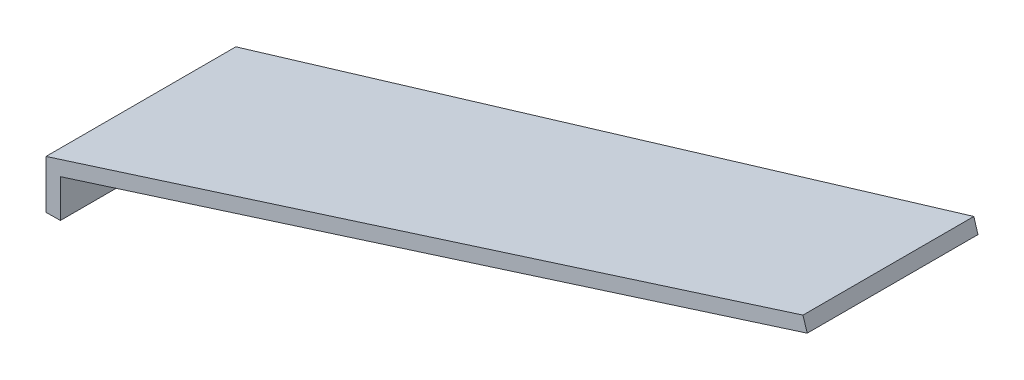
ISO-10303-21;
HEADER;
FILE_DESCRIPTION(('STEP AP214'),'2;1');
FILE_NAME('part.step','',(''),(''),'','','');
FILE_SCHEMA(('AUTOMOTIVE_DESIGN { 1 0 10303 214 1 1 1 1 }'));
ENDSEC;
DATA;
#1=APPLICATION_CONTEXT('core data for automotive mechanical design processes');
#2=APPLICATION_PROTOCOL_DEFINITION('international standard','automotive_design',2000,#1);
#3=PRODUCT_CONTEXT('',#1,'mechanical');
#4=PRODUCT('Part','Part','',(#3));
#5=PRODUCT_RELATED_PRODUCT_CATEGORY('part','',(#4));
#6=PRODUCT_DEFINITION_FORMATION('','',#4);
#7=PRODUCT_DEFINITION_CONTEXT('part definition',#1,'design');
#8=PRODUCT_DEFINITION('design','',#6,#7);
#9=PRODUCT_DEFINITION_SHAPE('','',#8);
#10=(LENGTH_UNIT() NAMED_UNIT(*) SI_UNIT(.MILLI.,.METRE.));
#11=(NAMED_UNIT(*) PLANE_ANGLE_UNIT() SI_UNIT($,.RADIAN.));
#12=(NAMED_UNIT(*) SI_UNIT($,.STERADIAN.) SOLID_ANGLE_UNIT());
#13=UNCERTAINTY_MEASURE_WITH_UNIT(LENGTH_MEASURE(1.E-05),#10,'distance_accuracy_value','');
#14=(GEOMETRIC_REPRESENTATION_CONTEXT(3) GLOBAL_UNCERTAINTY_ASSIGNED_CONTEXT((#13)) GLOBAL_UNIT_ASSIGNED_CONTEXT((#10,
#11,#12)) REPRESENTATION_CONTEXT('',''));
#15=CARTESIAN_POINT('',(0.,0.,0.));
#16=DIRECTION('',(0.,0.,1.));
#17=DIRECTION('',(1.,0.,0.));
#18=AXIS2_PLACEMENT_3D('',#15,#16,#17);
#19=CARTESIAN_POINT('',(0.,0.8,2.));
#20=DIRECTION('',(-0.295927265060346,0.955210476174704,0.));
#21=DIRECTION('',(-0.955210476174704,-0.295927265060346,0.));
#22=AXIS2_PLACEMENT_3D('',#19,#20,#21);
#23=PLANE('',#22);
#24=DIRECTION('',(0.955140199389065,0.295905493087058,-0.012130073038637));
#25=VECTOR('',#24,1.);
#26=CARTESIAN_POINT('',(-4.41416015768008E-05,0.799986324790446,1.99619062576042));
#27=LINE('',#26,#25);
#28=CARTESIAN_POINT('',(0.,0.8,1.99619006517167));
#29=VERTEX_POINT('',#28);
#30=CARTESIAN_POINT('',(15.5370790569609,5.61343685714759,1.7988725364062));
#31=VERTEX_POINT('',#30);
#32=EDGE_CURVE('E117',#29,#31,#27,.T.);
#33=ORIENTED_EDGE('',*,*,#32,.F.);
#34=DIRECTION('',(0.,0.,-1.));
#35=VECTOR('',#34,1.);
#36=CARTESIAN_POINT('',(0.,0.8,2.));
#37=LINE('',#36,#35);
#38=CARTESIAN_POINT('',(0.,0.8,-1.99619006517167));
#39=VERTEX_POINT('',#38);
#40=EDGE_CURVE('E74',#29,#39,#37,.T.);
#41=ORIENTED_EDGE('',*,*,#40,.T.);
#42=DIRECTION('',(-0.955140199389065,-0.295905493087058,-0.012130073038637));
#43=VECTOR('',#42,1.);
#44=CARTESIAN_POINT('',(0.046299539921334,0.814343745765166,-1.99560207107273));
#45=LINE('',#44,#43);
#46=CARTESIAN_POINT('',(15.5370790569609,5.61343685714759,-1.7988725364062));
#47=VERTEX_POINT('',#46);
#48=EDGE_CURVE('E108',#47,#39,#45,.T.);
#49=ORIENTED_EDGE('',*,*,#48,.F.);
#50=DIRECTION('',(0.,0.,-1.));
#51=VECTOR('',#50,1.);
#52=CARTESIAN_POINT('',(15.5370790569609,5.61343685714759,2.));
#53=LINE('',#52,#51);
#54=EDGE_CURVE('E11',#31,#47,#53,.T.);
#55=ORIENTED_EDGE('',*,*,#54,.F.);
#56=EDGE_LOOP('',(#33,#41,#49,#55));
#57=FACE_BOUND('',#56,.T.);
#58=ADVANCED_FACE('F16',(#57),#23,.F.);
#59=CARTESIAN_POINT('',(15.4483008774428,5.9,2.));
#60=DIRECTION('',(-0.955210476174704,-0.295927265060344,0.));
#61=DIRECTION('',(0.295927265060344,-0.955210476174704,0.));
#62=AXIS2_PLACEMENT_3D('',#59,#60,#61);
#63=PLANE('',#62);
#64=DIRECTION('',(-0.295925175220864,0.955203730474661,0.0037581854388461));
#65=VECTOR('',#64,1.);
#66=CARTESIAN_POINT('',(15.4480784491059,5.9007179665502,1.80000282479156));
#67=LINE('',#66,#65);
#68=CARTESIAN_POINT('',(15.4483008774428,5.9,1.8));
#69=VERTEX_POINT('',#68);
#70=EDGE_CURVE('E124',#31,#69,#67,.T.);
#71=ORIENTED_EDGE('',*,*,#70,.F.);
#72=ORIENTED_EDGE('',*,*,#54,.T.);
#73=DIRECTION('',(0.295925175220864,-0.955203730474661,0.0037581854388461));
#74=VECTOR('',#73,1.);
#75=CARTESIAN_POINT('',(15.4525270158439,5.8863586355462,-1.79994632896039));
#76=LINE('',#75,#74);
#77=CARTESIAN_POINT('',(15.4483008774428,5.9,-1.8));
#78=VERTEX_POINT('',#77);
#79=EDGE_CURVE('E103',#78,#47,#76,.T.);
#80=ORIENTED_EDGE('',*,*,#79,.F.);
#81=DIRECTION('',(0.,0.,-1.));
#82=VECTOR('',#81,1.);
#83=CARTESIAN_POINT('',(15.4483008774428,5.9,2.));
#84=LINE('',#83,#82);
#85=EDGE_CURVE('E23',#69,#78,#84,.T.);
#86=ORIENTED_EDGE('',*,*,#85,.F.);
#87=EDGE_LOOP('',(#71,#72,#80,#86));
#88=FACE_BOUND('',#87,.T.);
#89=ADVANCED_FACE('F106',(#88),#63,.F.);
#90=CARTESIAN_POINT('',(-0.3,1.02112594632313,2.));
#91=DIRECTION('',(0.295927265060346,-0.955210476174704,0.));
#92=DIRECTION('',(0.955210476174704,0.295927265060346,0.));
#93=AXIS2_PLACEMENT_3D('',#90,#91,#92);
#94=PLANE('',#93);
#95=DIRECTION('',(-0.955140199389065,-0.295905493087058,0.012130073038637));
#96=VECTOR('',#95,1.);
#97=CARTESIAN_POINT('',(-0.3,1.02112594632313,2.));
#98=LINE('',#97,#96);
#99=CARTESIAN_POINT('',(-0.3,1.02112594632313,2.));
#100=VERTEX_POINT('',#99);
#101=EDGE_CURVE('E30',#69,#100,#98,.T.);
#102=ORIENTED_EDGE('',*,*,#101,.F.);
#103=ORIENTED_EDGE('',*,*,#85,.T.);
#104=DIRECTION('',(0.955140199389065,0.295905493087058,0.012130073038637));
#105=VECTOR('',#104,1.);
#106=CARTESIAN_POINT('',(-0.253656318477089,1.03548336729785,-1.99941144531231));
#107=LINE('',#106,#105);
#108=CARTESIAN_POINT('',(-0.3,1.02112594632313,-2.));
#109=VERTEX_POINT('',#108);
#110=EDGE_CURVE('E96',#109,#78,#107,.T.);
#111=ORIENTED_EDGE('',*,*,#110,.F.);
#112=DIRECTION('',(0.,0.,-1.));
#113=VECTOR('',#112,1.);
#114=CARTESIAN_POINT('',(-0.3,1.02112594632313,2.));
#115=LINE('',#114,#113);
#116=EDGE_CURVE('E86',#100,#109,#115,.T.);
#117=ORIENTED_EDGE('',*,*,#116,.F.);
#118=EDGE_LOOP('',(#102,#103,#111,#117));
#119=FACE_BOUND('',#118,.T.);
#120=ADVANCED_FACE('F95',(#119),#94,.F.);
#121=CARTESIAN_POINT('',(0.,0.,2.));
#122=DIRECTION('',(0.,1.,0.));
#123=DIRECTION('',(-1.,0.,0.));
#124=AXIS2_PLACEMENT_3D('',#121,#122,#123);
#125=PLANE('',#124);
#126=DIRECTION('',(-0.999919367512356,0.,0.0126987587460257));
#127=VECTOR('',#126,1.);
#128=CARTESIAN_POINT('',(-0.3,0.,2.));
#129=LINE('',#128,#127);
#130=CARTESIAN_POINT('',(0.,0.,1.99619006517167));
#131=VERTEX_POINT('',#130);
#132=CARTESIAN_POINT('',(-0.3,0.,2.));
#133=VERTEX_POINT('',#132);
#134=EDGE_CURVE('E69',#131,#133,#129,.T.);
#135=ORIENTED_EDGE('',*,*,#134,.T.);
#136=DIRECTION('',(0.,0.,-1.));
#137=VECTOR('',#136,1.);
#138=CARTESIAN_POINT('',(-0.3,0.,2.));
#139=LINE('',#138,#137);
#140=CARTESIAN_POINT('',(-0.3,0.,-2.));
#141=VERTEX_POINT('',#140);
#142=EDGE_CURVE('E81',#133,#141,#139,.T.);
#143=ORIENTED_EDGE('',*,*,#142,.T.);
#144=DIRECTION('',(0.999919367512356,0.,0.0126987587460257));
#145=VECTOR('',#144,1.);
#146=CARTESIAN_POINT('',(-0.3,0.,-2.));
#147=LINE('',#146,#145);
#148=CARTESIAN_POINT('',(0.,0.,-1.99619006517167));
#149=VERTEX_POINT('',#148);
#150=EDGE_CURVE('E38',#141,#149,#147,.T.);
#151=ORIENTED_EDGE('',*,*,#150,.T.);
#152=DIRECTION('',(0.,0.,-1.));
#153=VECTOR('',#152,1.);
#154=CARTESIAN_POINT('',(0.,0.,2.));
#155=LINE('',#154,#153);
#156=EDGE_CURVE('E82',#131,#149,#155,.T.);
#157=ORIENTED_EDGE('',*,*,#156,.F.);
#158=EDGE_LOOP('',(#135,#143,#151,#157));
#159=FACE_BOUND('',#158,.T.);
#160=ADVANCED_FACE('F80',(#159),#125,.F.);
#161=CARTESIAN_POINT('',(0.,0.,2.));
#162=DIRECTION('',(-1.,0.,0.));
#163=DIRECTION('',(0.,0.,1.));
#164=AXIS2_PLACEMENT_3D('',#161,#162,#163);
#165=PLANE('',#164);
#166=DIRECTION('',(0.,1.,0.));
#167=VECTOR('',#166,1.);
#168=CARTESIAN_POINT('',(0.,0.,1.99619006517167));
#169=LINE('',#168,#167);
#170=EDGE_CURVE('E83',#131,#29,#169,.T.);
#171=ORIENTED_EDGE('',*,*,#170,.F.);
#172=ORIENTED_EDGE('',*,*,#156,.T.);
#173=DIRECTION('',(0.,-1.,0.));
#174=VECTOR('',#173,1.);
#175=CARTESIAN_POINT('',(0.,0.,-1.99619006517167));
#176=LINE('',#175,#174);
#177=EDGE_CURVE('E110',#39,#149,#176,.T.);
#178=ORIENTED_EDGE('',*,*,#177,.F.);
#179=ORIENTED_EDGE('',*,*,#40,.F.);
#180=EDGE_LOOP('',(#171,#172,#178,#179));
#181=FACE_BOUND('',#180,.T.);
#182=ADVANCED_FACE('F120',(#181),#165,.F.);
#183=CARTESIAN_POINT('',(-0.3,1.02112594632313,2.));
#184=DIRECTION('',(1.,0.,0.));
#185=DIRECTION('',(0.,1.,0.));
#186=AXIS2_PLACEMENT_3D('',#183,#184,#185);
#187=PLANE('',#186);
#188=DIRECTION('',(0.,-1.,0.));
#189=VECTOR('',#188,1.);
#190=CARTESIAN_POINT('',(-0.3,1.02112594632313,-2.));
#191=LINE('',#190,#189);
#192=EDGE_CURVE('E75',#109,#141,#191,.T.);
#193=ORIENTED_EDGE('',*,*,#192,.T.);
#194=ORIENTED_EDGE('',*,*,#142,.F.);
#195=DIRECTION('',(0.,-1.,0.));
#196=VECTOR('',#195,1.);
#197=CARTESIAN_POINT('',(-0.3,1.02112594632313,2.));
#198=LINE('',#197,#196);
#199=EDGE_CURVE('E66',#100,#133,#198,.T.);
#200=ORIENTED_EDGE('',*,*,#199,.F.);
#201=ORIENTED_EDGE('',*,*,#116,.T.);
#202=EDGE_LOOP('',(#193,#194,#200,#201));
#203=FACE_BOUND('',#202,.T.);
#204=ADVANCED_FACE('F85',(#203),#187,.F.);
#205=CARTESIAN_POINT('',(-0.3,5.9,-2.));
#206=DIRECTION('',(0.0126987587460257,0.,-0.999919367512356));
#207=DIRECTION('',(-0.999919367512356,0.,-0.0126987587460257));
#208=AXIS2_PLACEMENT_3D('',#205,#206,#207);
#209=PLANE('',#208);
#210=ORIENTED_EDGE('',*,*,#110,.T.);
#211=ORIENTED_EDGE('',*,*,#79,.T.);
#212=ORIENTED_EDGE('',*,*,#48,.T.);
#213=ORIENTED_EDGE('',*,*,#177,.T.);
#214=ORIENTED_EDGE('',*,*,#150,.F.);
#215=ORIENTED_EDGE('',*,*,#192,.F.);
#216=EDGE_LOOP('',(#210,#211,#212,#213,#214,#215));
#217=FACE_BOUND('',#216,.T.);
#218=ADVANCED_FACE('F101',(#217),#209,.T.);
#219=CARTESIAN_POINT('',(-0.3,5.9,2.));
#220=DIRECTION('',(0.0126987587460257,0.,0.999919367512356));
#221=DIRECTION('',(0.999919367512356,0.,-0.0126987587460257));
#222=AXIS2_PLACEMENT_3D('',#219,#220,#221);
#223=PLANE('',#222);
#224=ORIENTED_EDGE('',*,*,#101,.T.);
#225=ORIENTED_EDGE('',*,*,#199,.T.);
#226=ORIENTED_EDGE('',*,*,#134,.F.);
#227=ORIENTED_EDGE('',*,*,#170,.T.);
#228=ORIENTED_EDGE('',*,*,#32,.T.);
#229=ORIENTED_EDGE('',*,*,#70,.T.);
#230=EDGE_LOOP('',(#224,#225,#226,#227,#228,#229));
#231=FACE_BOUND('',#230,.T.);
#232=ADVANCED_FACE('F68',(#231),#223,.T.);
#233=CLOSED_SHELL('',(#58,#89,#120,#160,#182,#204,#218,#232));
#234=MANIFOLD_SOLID_BREP('B1',#233);
#235=ADVANCED_BREP_SHAPE_REPRESENTATION('',(#18,#234),#14);
#236=SHAPE_DEFINITION_REPRESENTATION(#9,#235);
ENDSEC;
END-ISO-10303-21;
